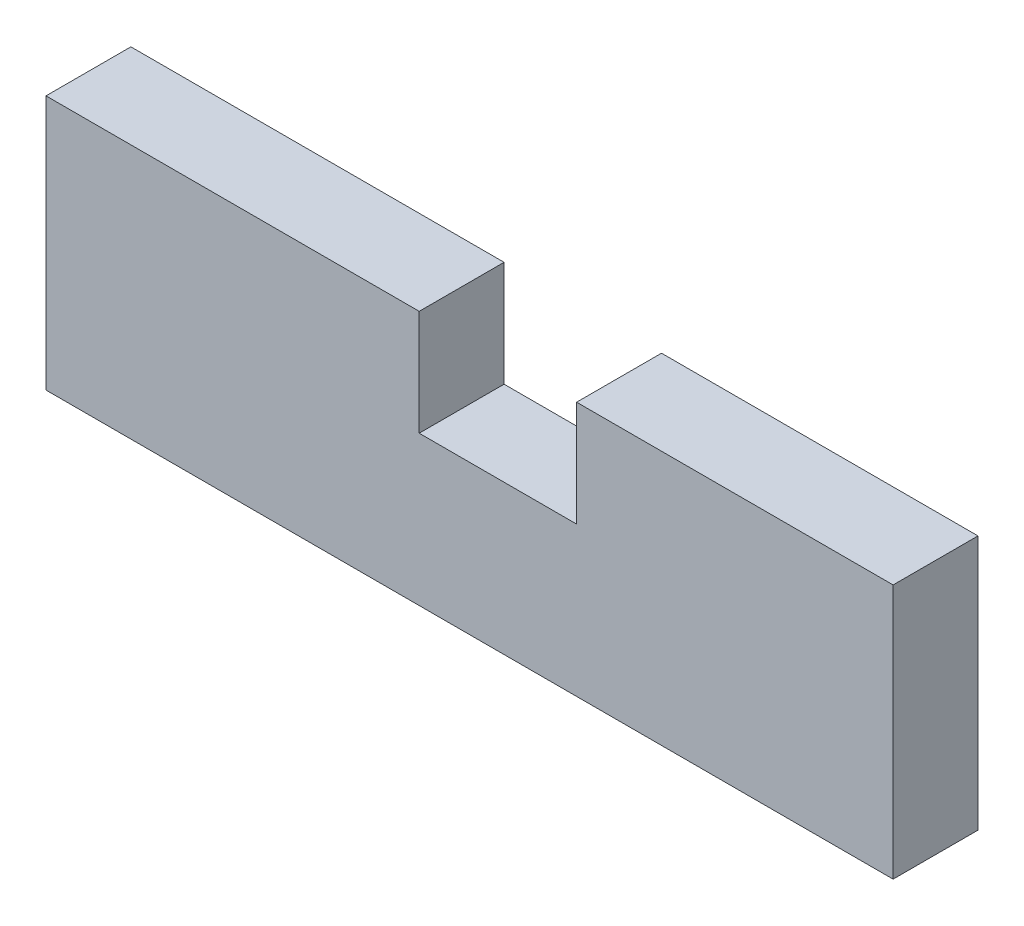
ISO-10303-21;
HEADER;
FILE_DESCRIPTION(('STEP AP214'),'2;1');
FILE_NAME('part.step','',(''),(''),'','','');
FILE_SCHEMA(('AUTOMOTIVE_DESIGN { 1 0 10303 214 1 1 1 1 }'));
ENDSEC;
DATA;
#1=APPLICATION_CONTEXT('core data for automotive mechanical design processes');
#2=APPLICATION_PROTOCOL_DEFINITION('international standard','automotive_design',2000,#1);
#3=PRODUCT_CONTEXT('',#1,'mechanical');
#4=PRODUCT('Part','Part','',(#3));
#5=PRODUCT_RELATED_PRODUCT_CATEGORY('part','',(#4));
#6=PRODUCT_DEFINITION_FORMATION('','',#4);
#7=PRODUCT_DEFINITION_CONTEXT('part definition',#1,'design');
#8=PRODUCT_DEFINITION('design','',#6,#7);
#9=PRODUCT_DEFINITION_SHAPE('','',#8);
#10=(LENGTH_UNIT() NAMED_UNIT(*) SI_UNIT(.MILLI.,.METRE.));
#11=(NAMED_UNIT(*) PLANE_ANGLE_UNIT() SI_UNIT($,.RADIAN.));
#12=(NAMED_UNIT(*) SI_UNIT($,.STERADIAN.) SOLID_ANGLE_UNIT());
#13=UNCERTAINTY_MEASURE_WITH_UNIT(LENGTH_MEASURE(1.E-05),#10,'distance_accuracy_value','');
#14=(GEOMETRIC_REPRESENTATION_CONTEXT(3) GLOBAL_UNCERTAINTY_ASSIGNED_CONTEXT((#13)) GLOBAL_UNIT_ASSIGNED_CONTEXT((#10,
#11,#12)) REPRESENTATION_CONTEXT('',''));
#15=CARTESIAN_POINT('',(0.,0.,0.));
#16=DIRECTION('',(0.,0.,1.));
#17=DIRECTION('',(1.,0.,0.));
#18=AXIS2_PLACEMENT_3D('',#15,#16,#17);
#19=CARTESIAN_POINT('',(0.,60.03623073256,20.));
#20=DIRECTION('',(1.,0.,0.));
#21=DIRECTION('',(0.,0.,-1.));
#22=AXIS2_PLACEMENT_3D('',#19,#20,#21);
#23=PLANE('',#22);
#24=DIRECTION('',(0.,-1.,0.));
#25=VECTOR('',#24,1.);
#26=CARTESIAN_POINT('',(0.,60.03623073256,0.));
#27=LINE('',#26,#25);
#28=CARTESIAN_POINT('',(0.,60.03623073256,0.));
#29=VERTEX_POINT('',#28);
#30=CARTESIAN_POINT('',(0.,0.,0.));
#31=VERTEX_POINT('',#30);
#32=EDGE_CURVE('E130',#29,#31,#27,.T.);
#33=ORIENTED_EDGE('',*,*,#32,.T.);
#34=DIRECTION('',(0.,0.,-1.));
#35=VECTOR('',#34,1.);
#36=CARTESIAN_POINT('',(0.,0.,20.));
#37=LINE('',#36,#35);
#38=CARTESIAN_POINT('',(0.,0.,20.));
#39=VERTEX_POINT('',#38);
#40=EDGE_CURVE('E11',#39,#31,#37,.T.);
#41=ORIENTED_EDGE('',*,*,#40,.F.);
#42=DIRECTION('',(0.,-1.,0.));
#43=VECTOR('',#42,1.);
#44=CARTESIAN_POINT('',(0.,60.03623073256,20.));
#45=LINE('',#44,#43);
#46=CARTESIAN_POINT('',(0.,60.03623073256,20.));
#47=VERTEX_POINT('',#46);
#48=EDGE_CURVE('E144',#47,#39,#45,.T.);
#49=ORIENTED_EDGE('',*,*,#48,.F.);
#50=DIRECTION('',(0.,0.,-1.));
#51=VECTOR('',#50,1.);
#52=CARTESIAN_POINT('',(0.,60.03623073256,20.));
#53=LINE('',#52,#51);
#54=EDGE_CURVE('E126',#47,#29,#53,.T.);
#55=ORIENTED_EDGE('',*,*,#54,.T.);
#56=EDGE_LOOP('',(#33,#41,#49,#55));
#57=FACE_BOUND('',#56,.T.);
#58=ADVANCED_FACE('F34',(#57),#23,.F.);
#59=CARTESIAN_POINT('',(0.,0.,20.));
#60=DIRECTION('',(0.,1.,0.));
#61=DIRECTION('',(0.,0.,1.));
#62=AXIS2_PLACEMENT_3D('',#59,#60,#61);
#63=PLANE('',#62);
#64=DIRECTION('',(1.,0.,0.));
#65=VECTOR('',#64,1.);
#66=CARTESIAN_POINT('',(0.,0.,0.));
#67=LINE('',#66,#65);
#68=CARTESIAN_POINT('',(199.570972782325,0.,0.));
#69=VERTEX_POINT('',#68);
#70=EDGE_CURVE('E133',#31,#69,#67,.T.);
#71=ORIENTED_EDGE('',*,*,#70,.T.);
#72=DIRECTION('',(0.,0.,-1.));
#73=VECTOR('',#72,1.);
#74=CARTESIAN_POINT('',(199.570972782325,0.,20.));
#75=LINE('',#74,#73);
#76=CARTESIAN_POINT('',(199.570972782325,0.,20.));
#77=VERTEX_POINT('',#76);
#78=EDGE_CURVE('E42',#77,#69,#75,.T.);
#79=ORIENTED_EDGE('',*,*,#78,.F.);
#80=DIRECTION('',(1.,0.,0.));
#81=VECTOR('',#80,1.);
#82=CARTESIAN_POINT('',(0.,0.,20.));
#83=LINE('',#82,#81);
#84=EDGE_CURVE('E93',#39,#77,#83,.T.);
#85=ORIENTED_EDGE('',*,*,#84,.F.);
#86=ORIENTED_EDGE('',*,*,#40,.T.);
#87=EDGE_LOOP('',(#71,#79,#85,#86));
#88=FACE_BOUND('',#87,.T.);
#89=ADVANCED_FACE('F179',(#88),#63,.F.);
#90=CARTESIAN_POINT('',(199.570972782325,0.,20.));
#91=DIRECTION('',(-1.,0.,0.));
#92=DIRECTION('',(0.,0.,1.));
#93=AXIS2_PLACEMENT_3D('',#90,#91,#92);
#94=PLANE('',#93);
#95=DIRECTION('',(0.,1.,0.));
#96=VECTOR('',#95,1.);
#97=CARTESIAN_POINT('',(199.570972782325,0.,0.));
#98=LINE('',#97,#96);
#99=CARTESIAN_POINT('',(199.570972782325,60.03623073256,0.));
#100=VERTEX_POINT('',#99);
#101=EDGE_CURVE('E135',#69,#100,#98,.T.);
#102=ORIENTED_EDGE('',*,*,#101,.T.);
#103=DIRECTION('',(0.,0.,-1.));
#104=VECTOR('',#103,1.);
#105=CARTESIAN_POINT('',(199.570972782325,60.03623073256,20.));
#106=LINE('',#105,#104);
#107=CARTESIAN_POINT('',(199.570972782325,60.03623073256,20.));
#108=VERTEX_POINT('',#107);
#109=EDGE_CURVE('E151',#108,#100,#106,.T.);
#110=ORIENTED_EDGE('',*,*,#109,.F.);
#111=DIRECTION('',(0.,1.,0.));
#112=VECTOR('',#111,1.);
#113=CARTESIAN_POINT('',(199.570972782325,0.,20.));
#114=LINE('',#113,#112);
#115=EDGE_CURVE('E159',#77,#108,#114,.T.);
#116=ORIENTED_EDGE('',*,*,#115,.F.);
#117=ORIENTED_EDGE('',*,*,#78,.T.);
#118=EDGE_LOOP('',(#102,#110,#116,#117));
#119=FACE_BOUND('',#118,.T.);
#120=ADVANCED_FACE('F157',(#119),#94,.F.);
#121=CARTESIAN_POINT('',(199.570972782325,60.03623073256,20.));
#122=DIRECTION('',(0.,-1.,0.));
#123=DIRECTION('',(0.,0.,-1.));
#124=AXIS2_PLACEMENT_3D('',#121,#122,#123);
#125=PLANE('',#124);
#126=DIRECTION('',(-1.,0.,0.));
#127=VECTOR('',#126,1.);
#128=CARTESIAN_POINT('',(199.570972782325,60.03623073256,0.));
#129=LINE('',#128,#127);
#130=CARTESIAN_POINT('',(125.007370997437,60.03623073256,0.));
#131=VERTEX_POINT('',#130);
#132=EDGE_CURVE('E137',#100,#131,#129,.T.);
#133=ORIENTED_EDGE('',*,*,#132,.T.);
#134=DIRECTION('',(0.,0.,-1.));
#135=VECTOR('',#134,1.);
#136=CARTESIAN_POINT('',(125.007370997437,60.03623073256,20.));
#137=LINE('',#136,#135);
#138=CARTESIAN_POINT('',(125.007370997437,60.03623073256,20.));
#139=VERTEX_POINT('',#138);
#140=EDGE_CURVE('E148',#139,#131,#137,.T.);
#141=ORIENTED_EDGE('',*,*,#140,.F.);
#142=DIRECTION('',(-1.,0.,0.));
#143=VECTOR('',#142,1.);
#144=CARTESIAN_POINT('',(199.570972782325,60.03623073256,20.));
#145=LINE('',#144,#143);
#146=EDGE_CURVE('E171',#108,#139,#145,.T.);
#147=ORIENTED_EDGE('',*,*,#146,.F.);
#148=ORIENTED_EDGE('',*,*,#109,.T.);
#149=EDGE_LOOP('',(#133,#141,#147,#148));
#150=FACE_BOUND('',#149,.T.);
#151=ADVANCED_FACE('F167',(#150),#125,.F.);
#152=CARTESIAN_POINT('',(125.007370997437,60.03623073256,20.));
#153=DIRECTION('',(1.,0.,0.));
#154=DIRECTION('',(0.,0.,-1.));
#155=AXIS2_PLACEMENT_3D('',#152,#153,#154);
#156=PLANE('',#155);
#157=DIRECTION('',(0.,-1.,0.));
#158=VECTOR('',#157,1.);
#159=CARTESIAN_POINT('',(125.007370997437,60.03623073256,0.));
#160=LINE('',#159,#158);
#161=CARTESIAN_POINT('',(125.007370997437,35.1652888754968,0.));
#162=VERTEX_POINT('',#161);
#163=EDGE_CURVE('E139',#131,#162,#160,.T.);
#164=ORIENTED_EDGE('',*,*,#163,.T.);
#165=DIRECTION('',(0.,0.,-1.));
#166=VECTOR('',#165,1.);
#167=CARTESIAN_POINT('',(125.007370997437,35.1652888754968,20.));
#168=LINE('',#167,#166);
#169=CARTESIAN_POINT('',(125.007370997437,35.1652888754968,20.));
#170=VERTEX_POINT('',#169);
#171=EDGE_CURVE('E121',#170,#162,#168,.T.);
#172=ORIENTED_EDGE('',*,*,#171,.F.);
#173=DIRECTION('',(0.,-1.,0.));
#174=VECTOR('',#173,1.);
#175=CARTESIAN_POINT('',(125.007370997437,60.03623073256,20.));
#176=LINE('',#175,#174);
#177=EDGE_CURVE('E112',#139,#170,#176,.T.);
#178=ORIENTED_EDGE('',*,*,#177,.F.);
#179=ORIENTED_EDGE('',*,*,#140,.T.);
#180=EDGE_LOOP('',(#164,#172,#178,#179));
#181=FACE_BOUND('',#180,.T.);
#182=ADVANCED_FACE('F170',(#181),#156,.F.);
#183=CARTESIAN_POINT('',(125.007370997437,35.1652888754968,20.));
#184=DIRECTION('',(0.,-1.,0.));
#185=DIRECTION('',(1.,0.,0.));
#186=AXIS2_PLACEMENT_3D('',#183,#184,#185);
#187=PLANE('',#186);
#188=DIRECTION('',(-1.,0.,0.));
#189=VECTOR('',#188,1.);
#190=CARTESIAN_POINT('',(125.007370997437,35.1652888754968,0.));
#191=LINE('',#190,#189);
#192=CARTESIAN_POINT('',(87.9223559012987,35.1652888754968,0.));
#193=VERTEX_POINT('',#192);
#194=EDGE_CURVE('E120',#162,#193,#191,.T.);
#195=ORIENTED_EDGE('',*,*,#194,.T.);
#196=DIRECTION('',(0.,0.,-1.));
#197=VECTOR('',#196,1.);
#198=CARTESIAN_POINT('',(87.9223559012987,35.1652888754968,20.));
#199=LINE('',#198,#197);
#200=CARTESIAN_POINT('',(87.9223559012987,35.1652888754968,20.));
#201=VERTEX_POINT('',#200);
#202=EDGE_CURVE('E117',#201,#193,#199,.T.);
#203=ORIENTED_EDGE('',*,*,#202,.F.);
#204=DIRECTION('',(-1.,0.,0.));
#205=VECTOR('',#204,1.);
#206=CARTESIAN_POINT('',(125.007370997437,35.1652888754968,20.));
#207=LINE('',#206,#205);
#208=EDGE_CURVE('E106',#170,#201,#207,.T.);
#209=ORIENTED_EDGE('',*,*,#208,.F.);
#210=ORIENTED_EDGE('',*,*,#171,.T.);
#211=EDGE_LOOP('',(#195,#203,#209,#210));
#212=FACE_BOUND('',#211,.T.);
#213=ADVANCED_FACE('F118',(#212),#187,.F.);
#214=CARTESIAN_POINT('',(87.9223559012987,35.1652888754968,20.));
#215=DIRECTION('',(-1.,0.,0.));
#216=DIRECTION('',(0.,0.,1.));
#217=AXIS2_PLACEMENT_3D('',#214,#215,#216);
#218=PLANE('',#217);
#219=DIRECTION('',(0.,1.,0.));
#220=VECTOR('',#219,1.);
#221=CARTESIAN_POINT('',(87.9223559012987,35.1652888754968,0.));
#222=LINE('',#221,#220);
#223=CARTESIAN_POINT('',(87.9223559012987,60.03623073256,0.));
#224=VERTEX_POINT('',#223);
#225=EDGE_CURVE('E79',#193,#224,#222,.T.);
#226=ORIENTED_EDGE('',*,*,#225,.T.);
#227=DIRECTION('',(0.,0.,-1.));
#228=VECTOR('',#227,1.);
#229=CARTESIAN_POINT('',(87.9223559012987,60.03623073256,20.));
#230=LINE('',#229,#228);
#231=CARTESIAN_POINT('',(87.9223559012987,60.03623073256,20.));
#232=VERTEX_POINT('',#231);
#233=EDGE_CURVE('E122',#232,#224,#230,.T.);
#234=ORIENTED_EDGE('',*,*,#233,.F.);
#235=DIRECTION('',(0.,1.,0.));
#236=VECTOR('',#235,1.);
#237=CARTESIAN_POINT('',(87.9223559012987,35.1652888754968,20.));
#238=LINE('',#237,#236);
#239=EDGE_CURVE('E110',#201,#232,#238,.T.);
#240=ORIENTED_EDGE('',*,*,#239,.F.);
#241=ORIENTED_EDGE('',*,*,#202,.T.);
#242=EDGE_LOOP('',(#226,#234,#240,#241));
#243=FACE_BOUND('',#242,.T.);
#244=ADVANCED_FACE('F124',(#243),#218,.F.);
#245=CARTESIAN_POINT('',(87.9223559012987,60.03623073256,20.));
#246=DIRECTION('',(0.,-1.,0.));
#247=DIRECTION('',(0.,0.,-1.));
#248=AXIS2_PLACEMENT_3D('',#245,#246,#247);
#249=PLANE('',#248);
#250=DIRECTION('',(-1.,0.,0.));
#251=VECTOR('',#250,1.);
#252=CARTESIAN_POINT('',(87.9223559012987,60.03623073256,0.));
#253=LINE('',#252,#251);
#254=EDGE_CURVE('E85',#224,#29,#253,.T.);
#255=ORIENTED_EDGE('',*,*,#254,.T.);
#256=ORIENTED_EDGE('',*,*,#54,.F.);
#257=DIRECTION('',(-1.,0.,0.));
#258=VECTOR('',#257,1.);
#259=CARTESIAN_POINT('',(87.9223559012987,60.03623073256,20.));
#260=LINE('',#259,#258);
#261=EDGE_CURVE('E50',#232,#47,#260,.T.);
#262=ORIENTED_EDGE('',*,*,#261,.F.);
#263=ORIENTED_EDGE('',*,*,#233,.T.);
#264=EDGE_LOOP('',(#255,#256,#262,#263));
#265=FACE_BOUND('',#264,.T.);
#266=ADVANCED_FACE('F195',(#265),#249,.F.);
#267=CARTESIAN_POINT('',(0.,0.,20.));
#268=DIRECTION('',(0.,0.,1.));
#269=DIRECTION('',(1.,0.,0.));
#270=AXIS2_PLACEMENT_3D('',#267,#268,#269);
#271=PLANE('',#270);
#272=ORIENTED_EDGE('',*,*,#48,.T.);
#273=ORIENTED_EDGE('',*,*,#84,.T.);
#274=ORIENTED_EDGE('',*,*,#115,.T.);
#275=ORIENTED_EDGE('',*,*,#146,.T.);
#276=ORIENTED_EDGE('',*,*,#177,.T.);
#277=ORIENTED_EDGE('',*,*,#208,.T.);
#278=ORIENTED_EDGE('',*,*,#239,.T.);
#279=ORIENTED_EDGE('',*,*,#261,.T.);
#280=EDGE_LOOP('',(#272,#273,#274,#275,#276,#277,#278,#279));
#281=FACE_BOUND('',#280,.T.);
#282=ADVANCED_FACE('F108',(#281),#271,.T.);
#283=CARTESIAN_POINT('',(0.,0.,0.));
#284=DIRECTION('',(0.,0.,1.));
#285=DIRECTION('',(1.,0.,0.));
#286=AXIS2_PLACEMENT_3D('',#283,#284,#285);
#287=PLANE('',#286);
#288=ORIENTED_EDGE('',*,*,#32,.F.);
#289=ORIENTED_EDGE('',*,*,#254,.F.);
#290=ORIENTED_EDGE('',*,*,#225,.F.);
#291=ORIENTED_EDGE('',*,*,#194,.F.);
#292=ORIENTED_EDGE('',*,*,#163,.F.);
#293=ORIENTED_EDGE('',*,*,#132,.F.);
#294=ORIENTED_EDGE('',*,*,#101,.F.);
#295=ORIENTED_EDGE('',*,*,#70,.F.);
#296=EDGE_LOOP('',(#288,#289,#290,#291,#292,#293,#294,#295));
#297=FACE_BOUND('',#296,.T.);
#298=ADVANCED_FACE('F163',(#297),#287,.F.);
#299=CLOSED_SHELL('',(#58,#89,#120,#151,#182,#213,#244,#266,#282,#298));
#300=MANIFOLD_SOLID_BREP('B2',#299);
#301=ADVANCED_BREP_SHAPE_REPRESENTATION('',(#18,#300),#14);
#302=SHAPE_DEFINITION_REPRESENTATION(#9,#301);
ENDSEC;
END-ISO-10303-21;
